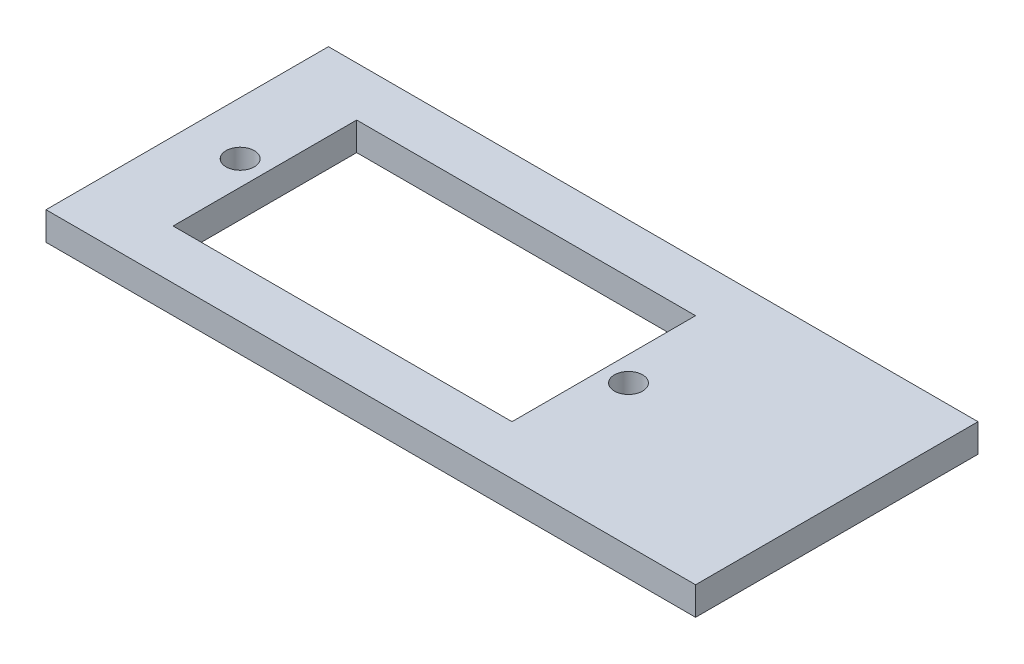
ISO-10303-21;
HEADER;
FILE_DESCRIPTION(('STEP AP214'),'2;1');
FILE_NAME('part.step','',(''),(''),'','','');
FILE_SCHEMA(('AUTOMOTIVE_DESIGN { 1 0 10303 214 1 1 1 1 }'));
ENDSEC;
DATA;
#1=APPLICATION_CONTEXT('core data for automotive mechanical design processes');
#2=APPLICATION_PROTOCOL_DEFINITION('international standard','automotive_design',2000,#1);
#3=PRODUCT_CONTEXT('',#1,'mechanical');
#4=PRODUCT('Part','Part','',(#3));
#5=PRODUCT_RELATED_PRODUCT_CATEGORY('part','',(#4));
#6=PRODUCT_DEFINITION_FORMATION('','',#4);
#7=PRODUCT_DEFINITION_CONTEXT('part definition',#1,'design');
#8=PRODUCT_DEFINITION('design','',#6,#7);
#9=PRODUCT_DEFINITION_SHAPE('','',#8);
#10=(LENGTH_UNIT() NAMED_UNIT(*) SI_UNIT(.MILLI.,.METRE.));
#11=(NAMED_UNIT(*) PLANE_ANGLE_UNIT() SI_UNIT($,.RADIAN.));
#12=(NAMED_UNIT(*) SI_UNIT($,.STERADIAN.) SOLID_ANGLE_UNIT());
#13=UNCERTAINTY_MEASURE_WITH_UNIT(LENGTH_MEASURE(1.E-05),#10,'distance_accuracy_value','');
#14=(GEOMETRIC_REPRESENTATION_CONTEXT(3) GLOBAL_UNCERTAINTY_ASSIGNED_CONTEXT((#13)) GLOBAL_UNIT_ASSIGNED_CONTEXT((#10,
#11,#12)) REPRESENTATION_CONTEXT('',''));
#15=CARTESIAN_POINT('',(0.,0.,0.));
#16=DIRECTION('',(0.,0.,1.));
#17=DIRECTION('',(1.,0.,0.));
#18=AXIS2_PLACEMENT_3D('',#15,#16,#17);
#19=CARTESIAN_POINT('',(-23.,2.,10.));
#20=DIRECTION('',(1.,0.,0.));
#21=DIRECTION('',(0.,0.,-1.));
#22=AXIS2_PLACEMENT_3D('',#19,#20,#21);
#23=PLANE('',#22);
#24=DIRECTION('',(0.,0.,1.));
#25=VECTOR('',#24,1.);
#26=CARTESIAN_POINT('',(-23.,0.,10.));
#27=LINE('',#26,#25);
#28=CARTESIAN_POINT('',(-23.,0.,-9.99999999999999));
#29=VERTEX_POINT('',#28);
#30=CARTESIAN_POINT('',(-23.,0.,10.));
#31=VERTEX_POINT('',#30);
#32=EDGE_CURVE('E136',#29,#31,#27,.T.);
#33=ORIENTED_EDGE('',*,*,#32,.T.);
#34=DIRECTION('',(0.,-1.,0.));
#35=VECTOR('',#34,1.);
#36=CARTESIAN_POINT('',(-23.,2.,10.));
#37=LINE('',#36,#35);
#38=CARTESIAN_POINT('',(-23.,2.,10.));
#39=VERTEX_POINT('',#38);
#40=EDGE_CURVE('E11',#39,#31,#37,.T.);
#41=ORIENTED_EDGE('',*,*,#40,.F.);
#42=DIRECTION('',(0.,0.,1.));
#43=VECTOR('',#42,1.);
#44=CARTESIAN_POINT('',(-23.,2.,10.));
#45=LINE('',#44,#43);
#46=CARTESIAN_POINT('',(-23.,2.,-9.99999999999999));
#47=VERTEX_POINT('',#46);
#48=EDGE_CURVE('E140',#47,#39,#45,.T.);
#49=ORIENTED_EDGE('',*,*,#48,.F.);
#50=DIRECTION('',(0.,-1.,0.));
#51=VECTOR('',#50,1.);
#52=CARTESIAN_POINT('',(-23.,2.,-9.99999999999999));
#53=LINE('',#52,#51);
#54=EDGE_CURVE('E150',#47,#29,#53,.T.);
#55=ORIENTED_EDGE('',*,*,#54,.T.);
#56=EDGE_LOOP('',(#33,#41,#49,#55));
#57=FACE_BOUND('',#56,.T.);
#58=ADVANCED_FACE('F35',(#57),#23,.F.);
#59=CARTESIAN_POINT('',(23.,2.,10.));
#60=DIRECTION('',(0.,0.,-1.));
#61=DIRECTION('',(-1.,0.,0.));
#62=AXIS2_PLACEMENT_3D('',#59,#60,#61);
#63=PLANE('',#62);
#64=DIRECTION('',(1.,0.,0.));
#65=VECTOR('',#64,1.);
#66=CARTESIAN_POINT('',(23.,0.,10.));
#67=LINE('',#66,#65);
#68=CARTESIAN_POINT('',(23.,0.,10.));
#69=VERTEX_POINT('',#68);
#70=EDGE_CURVE('E153',#31,#69,#67,.T.);
#71=ORIENTED_EDGE('',*,*,#70,.T.);
#72=DIRECTION('',(0.,-1.,0.));
#73=VECTOR('',#72,1.);
#74=CARTESIAN_POINT('',(23.,2.,10.));
#75=LINE('',#74,#73);
#76=CARTESIAN_POINT('',(23.,2.,10.));
#77=VERTEX_POINT('',#76);
#78=EDGE_CURVE('E42',#77,#69,#75,.T.);
#79=ORIENTED_EDGE('',*,*,#78,.F.);
#80=DIRECTION('',(1.,0.,0.));
#81=VECTOR('',#80,1.);
#82=CARTESIAN_POINT('',(23.,2.,10.));
#83=LINE('',#82,#81);
#84=EDGE_CURVE('E143',#39,#77,#83,.T.);
#85=ORIENTED_EDGE('',*,*,#84,.F.);
#86=ORIENTED_EDGE('',*,*,#40,.T.);
#87=EDGE_LOOP('',(#71,#79,#85,#86));
#88=FACE_BOUND('',#87,.T.);
#89=ADVANCED_FACE('F181',(#88),#63,.F.);
#90=CARTESIAN_POINT('',(23.,2.,10.));
#91=DIRECTION('',(-1.,0.,0.));
#92=DIRECTION('',(0.,0.,1.));
#93=AXIS2_PLACEMENT_3D('',#90,#91,#92);
#94=PLANE('',#93);
#95=DIRECTION('',(0.,0.,-1.));
#96=VECTOR('',#95,1.);
#97=CARTESIAN_POINT('',(23.,0.,10.));
#98=LINE('',#97,#96);
#99=CARTESIAN_POINT('',(23.,0.,-10.));
#100=VERTEX_POINT('',#99);
#101=EDGE_CURVE('E155',#69,#100,#98,.T.);
#102=ORIENTED_EDGE('',*,*,#101,.T.);
#103=DIRECTION('',(0.,-1.,0.));
#104=VECTOR('',#103,1.);
#105=CARTESIAN_POINT('',(23.,2.,-10.));
#106=LINE('',#105,#104);
#107=CARTESIAN_POINT('',(23.,2.,-10.));
#108=VERTEX_POINT('',#107);
#109=EDGE_CURVE('E160',#108,#100,#106,.T.);
#110=ORIENTED_EDGE('',*,*,#109,.F.);
#111=DIRECTION('',(0.,0.,-1.));
#112=VECTOR('',#111,1.);
#113=CARTESIAN_POINT('',(23.,2.,10.));
#114=LINE('',#113,#112);
#115=EDGE_CURVE('E146',#77,#108,#114,.T.);
#116=ORIENTED_EDGE('',*,*,#115,.F.);
#117=ORIENTED_EDGE('',*,*,#78,.T.);
#118=EDGE_LOOP('',(#102,#110,#116,#117));
#119=FACE_BOUND('',#118,.T.);
#120=ADVANCED_FACE('F167',(#119),#94,.F.);
#121=CARTESIAN_POINT('',(23.,2.,-10.));
#122=DIRECTION('',(0.,0.,1.));
#123=DIRECTION('',(1.,0.,0.));
#124=AXIS2_PLACEMENT_3D('',#121,#122,#123);
#125=PLANE('',#124);
#126=DIRECTION('',(-1.,0.,0.));
#127=VECTOR('',#126,1.);
#128=CARTESIAN_POINT('',(23.,0.,-10.));
#129=LINE('',#128,#127);
#130=EDGE_CURVE('E144',#100,#29,#129,.T.);
#131=ORIENTED_EDGE('',*,*,#130,.T.);
#132=ORIENTED_EDGE('',*,*,#54,.F.);
#133=DIRECTION('',(-1.,0.,0.));
#134=VECTOR('',#133,1.);
#135=CARTESIAN_POINT('',(23.,2.,-10.));
#136=LINE('',#135,#134);
#137=EDGE_CURVE('E148',#108,#47,#136,.T.);
#138=ORIENTED_EDGE('',*,*,#137,.F.);
#139=ORIENTED_EDGE('',*,*,#109,.T.);
#140=EDGE_LOOP('',(#131,#132,#138,#139));
#141=FACE_BOUND('',#140,.T.);
#142=ADVANCED_FACE('F174',(#141),#125,.F.);
#143=CARTESIAN_POINT('',(0.,2.,0.));
#144=DIRECTION('',(0.,1.,0.));
#145=DIRECTION('',(0.,0.,1.));
#146=AXIS2_PLACEMENT_3D('',#143,#144,#145);
#147=PLANE('',#146);
#148=CARTESIAN_POINT('',(8.25000000000001,2.,0.));
#149=DIRECTION('',(0.,1.,0.));
#150=DIRECTION('',(0.,0.,1.));
#151=AXIS2_PLACEMENT_3D('',#148,#149,#150);
#152=CIRCLE('',#151,1.);
#153=CARTESIAN_POINT('',(8.25000000000001,2.,1.));
#154=VERTEX_POINT('',#153);
#155=EDGE_CURVE('E223',#154,#154,#152,.T.);
#156=ORIENTED_EDGE('',*,*,#155,.F.);
#157=EDGE_LOOP('',(#156));
#158=FACE_BOUND('',#157,.T.);
#159=CARTESIAN_POINT('',(-19.25,2.,0.));
#160=DIRECTION('',(0.,1.,0.));
#161=DIRECTION('',(0.,0.,1.));
#162=AXIS2_PLACEMENT_3D('',#159,#160,#161);
#163=CIRCLE('',#162,1.);
#164=CARTESIAN_POINT('',(-19.25,2.,1.));
#165=VERTEX_POINT('',#164);
#166=EDGE_CURVE('E123',#165,#165,#163,.T.);
#167=ORIENTED_EDGE('',*,*,#166,.F.);
#168=EDGE_LOOP('',(#167));
#169=FACE_BOUND('',#168,.T.);
#170=DIRECTION('',(0.,0.,-1.));
#171=VECTOR('',#170,1.);
#172=CARTESIAN_POINT('',(6.50000000000001,2.,6.5));
#173=LINE('',#172,#171);
#174=CARTESIAN_POINT('',(6.50000000000001,2.,6.5));
#175=VERTEX_POINT('',#174);
#176=CARTESIAN_POINT('',(6.50000000000001,2.,-6.5));
#177=VERTEX_POINT('',#176);
#178=EDGE_CURVE('E49',#175,#177,#173,.T.);
#179=ORIENTED_EDGE('',*,*,#178,.F.);
#180=DIRECTION('',(1.,0.,0.));
#181=VECTOR('',#180,1.);
#182=CARTESIAN_POINT('',(-17.5,2.,6.5));
#183=LINE('',#182,#181);
#184=CARTESIAN_POINT('',(-17.5,2.,6.5));
#185=VERTEX_POINT('',#184);
#186=EDGE_CURVE('E117',#185,#175,#183,.T.);
#187=ORIENTED_EDGE('',*,*,#186,.F.);
#188=DIRECTION('',(0.,0.,1.));
#189=VECTOR('',#188,1.);
#190=CARTESIAN_POINT('',(-17.5,2.,6.5));
#191=LINE('',#190,#189);
#192=CARTESIAN_POINT('',(-17.5,2.,-6.5));
#193=VERTEX_POINT('',#192);
#194=EDGE_CURVE('E120',#193,#185,#191,.T.);
#195=ORIENTED_EDGE('',*,*,#194,.F.);
#196=DIRECTION('',(-1.,0.,0.));
#197=VECTOR('',#196,1.);
#198=CARTESIAN_POINT('',(-17.5,2.,-6.5));
#199=LINE('',#198,#197);
#200=EDGE_CURVE('E129',#177,#193,#199,.T.);
#201=ORIENTED_EDGE('',*,*,#200,.F.);
#202=EDGE_LOOP('',(#179,#187,#195,#201));
#203=FACE_BOUND('',#202,.T.);
#204=ORIENTED_EDGE('',*,*,#48,.T.);
#205=ORIENTED_EDGE('',*,*,#84,.T.);
#206=ORIENTED_EDGE('',*,*,#115,.T.);
#207=ORIENTED_EDGE('',*,*,#137,.T.);
#208=EDGE_LOOP('',(#204,#205,#206,#207));
#209=FACE_BOUND('',#208,.T.);
#210=ADVANCED_FACE('F180',(#158,#169,#203,#209),#147,.T.);
#211=CARTESIAN_POINT('',(0.,0.,0.));
#212=DIRECTION('',(0.,1.,0.));
#213=DIRECTION('',(0.,0.,1.));
#214=AXIS2_PLACEMENT_3D('',#211,#212,#213);
#215=PLANE('',#214);
#216=CARTESIAN_POINT('',(8.25000000000001,0.,0.));
#217=DIRECTION('',(0.,1.,0.));
#218=DIRECTION('',(0.,0.,1.));
#219=AXIS2_PLACEMENT_3D('',#216,#217,#218);
#220=CIRCLE('',#219,1.);
#221=CARTESIAN_POINT('',(8.25000000000001,0.,1.));
#222=VERTEX_POINT('',#221);
#223=EDGE_CURVE('E220',#222,#222,#220,.T.);
#224=ORIENTED_EDGE('',*,*,#223,.T.);
#225=EDGE_LOOP('',(#224));
#226=FACE_BOUND('',#225,.T.);
#227=CARTESIAN_POINT('',(-19.25,0.,0.));
#228=DIRECTION('',(0.,1.,0.));
#229=DIRECTION('',(0.,0.,1.));
#230=AXIS2_PLACEMENT_3D('',#227,#228,#229);
#231=CIRCLE('',#230,1.);
#232=CARTESIAN_POINT('',(-19.25,0.,1.));
#233=VERTEX_POINT('',#232);
#234=EDGE_CURVE('E130',#233,#233,#231,.T.);
#235=ORIENTED_EDGE('',*,*,#234,.T.);
#236=EDGE_LOOP('',(#235));
#237=FACE_BOUND('',#236,.T.);
#238=DIRECTION('',(1.,0.,0.));
#239=VECTOR('',#238,1.);
#240=CARTESIAN_POINT('',(-17.5,0.,6.5));
#241=LINE('',#240,#239);
#242=CARTESIAN_POINT('',(-17.5,0.,6.5));
#243=VERTEX_POINT('',#242);
#244=CARTESIAN_POINT('',(6.50000000000001,0.,6.5));
#245=VERTEX_POINT('',#244);
#246=EDGE_CURVE('E107',#243,#245,#241,.T.);
#247=ORIENTED_EDGE('',*,*,#246,.T.);
#248=DIRECTION('',(0.,0.,-1.));
#249=VECTOR('',#248,1.);
#250=CARTESIAN_POINT('',(6.50000000000001,0.,6.5));
#251=LINE('',#250,#249);
#252=CARTESIAN_POINT('',(6.50000000000001,0.,-6.5));
#253=VERTEX_POINT('',#252);
#254=EDGE_CURVE('E101',#245,#253,#251,.T.);
#255=ORIENTED_EDGE('',*,*,#254,.T.);
#256=DIRECTION('',(-1.,0.,0.));
#257=VECTOR('',#256,1.);
#258=CARTESIAN_POINT('',(-17.5,0.,-6.5));
#259=LINE('',#258,#257);
#260=CARTESIAN_POINT('',(-17.5,0.,-6.5));
#261=VERTEX_POINT('',#260);
#262=EDGE_CURVE('E110',#253,#261,#259,.T.);
#263=ORIENTED_EDGE('',*,*,#262,.T.);
#264=DIRECTION('',(0.,0.,1.));
#265=VECTOR('',#264,1.);
#266=CARTESIAN_POINT('',(-17.5,0.,6.5));
#267=LINE('',#266,#265);
#268=EDGE_CURVE('E57',#261,#243,#267,.T.);
#269=ORIENTED_EDGE('',*,*,#268,.T.);
#270=EDGE_LOOP('',(#247,#255,#263,#269));
#271=FACE_BOUND('',#270,.T.);
#272=ORIENTED_EDGE('',*,*,#32,.F.);
#273=ORIENTED_EDGE('',*,*,#130,.F.);
#274=ORIENTED_EDGE('',*,*,#101,.F.);
#275=ORIENTED_EDGE('',*,*,#70,.F.);
#276=EDGE_LOOP('',(#272,#273,#274,#275));
#277=FACE_BOUND('',#276,.T.);
#278=ADVANCED_FACE('F114',(#226,#237,#271,#277),#215,.F.);
#279=CARTESIAN_POINT('',(6.50000000000001,0.,6.5));
#280=DIRECTION('',(1.,0.,0.));
#281=DIRECTION('',(0.,0.,-1.));
#282=AXIS2_PLACEMENT_3D('',#279,#280,#281);
#283=PLANE('',#282);
#284=ORIENTED_EDGE('',*,*,#178,.T.);
#285=DIRECTION('',(0.,1.,0.));
#286=VECTOR('',#285,1.);
#287=CARTESIAN_POINT('',(6.50000000000001,0.,-6.5));
#288=LINE('',#287,#286);
#289=EDGE_CURVE('E97',#253,#177,#288,.T.);
#290=ORIENTED_EDGE('',*,*,#289,.F.);
#291=ORIENTED_EDGE('',*,*,#254,.F.);
#292=DIRECTION('',(0.,1.,0.));
#293=VECTOR('',#292,1.);
#294=CARTESIAN_POINT('',(6.50000000000001,0.,6.5));
#295=LINE('',#294,#293);
#296=EDGE_CURVE('E134',#245,#175,#295,.T.);
#297=ORIENTED_EDGE('',*,*,#296,.T.);
#298=EDGE_LOOP('',(#284,#290,#291,#297));
#299=FACE_BOUND('',#298,.T.);
#300=ADVANCED_FACE('F99',(#299),#283,.F.);
#301=CARTESIAN_POINT('',(-17.5,0.,6.5));
#302=DIRECTION('',(0.,0.,1.));
#303=DIRECTION('',(1.,0.,0.));
#304=AXIS2_PLACEMENT_3D('',#301,#302,#303);
#305=PLANE('',#304);
#306=ORIENTED_EDGE('',*,*,#186,.T.);
#307=ORIENTED_EDGE('',*,*,#296,.F.);
#308=ORIENTED_EDGE('',*,*,#246,.F.);
#309=DIRECTION('',(0.,1.,0.));
#310=VECTOR('',#309,1.);
#311=CARTESIAN_POINT('',(-17.5,0.,6.5));
#312=LINE('',#311,#310);
#313=EDGE_CURVE('E137',#243,#185,#312,.T.);
#314=ORIENTED_EDGE('',*,*,#313,.T.);
#315=EDGE_LOOP('',(#306,#307,#308,#314));
#316=FACE_BOUND('',#315,.T.);
#317=ADVANCED_FACE('F199',(#316),#305,.F.);
#318=CARTESIAN_POINT('',(-17.5,0.,6.5));
#319=DIRECTION('',(-1.,0.,0.));
#320=DIRECTION('',(0.,0.,1.));
#321=AXIS2_PLACEMENT_3D('',#318,#319,#320);
#322=PLANE('',#321);
#323=ORIENTED_EDGE('',*,*,#194,.T.);
#324=ORIENTED_EDGE('',*,*,#313,.F.);
#325=ORIENTED_EDGE('',*,*,#268,.F.);
#326=DIRECTION('',(0.,1.,0.));
#327=VECTOR('',#326,1.);
#328=CARTESIAN_POINT('',(-17.5,0.,-6.5));
#329=LINE('',#328,#327);
#330=EDGE_CURVE('E106',#261,#193,#329,.T.);
#331=ORIENTED_EDGE('',*,*,#330,.T.);
#332=EDGE_LOOP('',(#323,#324,#325,#331));
#333=FACE_BOUND('',#332,.T.);
#334=ADVANCED_FACE('F203',(#333),#322,.F.);
#335=CARTESIAN_POINT('',(-17.5,0.,-6.5));
#336=DIRECTION('',(0.,0.,-1.));
#337=DIRECTION('',(-1.,0.,0.));
#338=AXIS2_PLACEMENT_3D('',#335,#336,#337);
#339=PLANE('',#338);
#340=ORIENTED_EDGE('',*,*,#200,.T.);
#341=ORIENTED_EDGE('',*,*,#330,.F.);
#342=ORIENTED_EDGE('',*,*,#262,.F.);
#343=ORIENTED_EDGE('',*,*,#289,.T.);
#344=EDGE_LOOP('',(#340,#341,#342,#343));
#345=FACE_BOUND('',#344,.T.);
#346=ADVANCED_FACE('F111',(#345),#339,.F.);
#347=CARTESIAN_POINT('',(-19.25,0.,0.));
#348=DIRECTION('',(0.,1.,0.));
#349=DIRECTION('',(0.,0.,1.));
#350=AXIS2_PLACEMENT_3D('',#347,#348,#349);
#351=CYLINDRICAL_SURFACE('',#350,1.);
#352=ORIENTED_EDGE('',*,*,#234,.F.);
#353=EDGE_LOOP('',(#352));
#354=FACE_BOUND('',#353,.T.);
#355=ORIENTED_EDGE('',*,*,#166,.T.);
#356=EDGE_LOOP('',(#355));
#357=FACE_BOUND('',#356,.T.);
#358=ADVANCED_FACE('F202',(#354,#357),#351,.F.);
#359=CARTESIAN_POINT('',(8.25000000000001,0.,0.));
#360=DIRECTION('',(0.,1.,0.));
#361=DIRECTION('',(0.,0.,1.));
#362=AXIS2_PLACEMENT_3D('',#359,#360,#361);
#363=CYLINDRICAL_SURFACE('',#362,1.);
#364=ORIENTED_EDGE('',*,*,#223,.F.);
#365=EDGE_LOOP('',(#364));
#366=FACE_BOUND('',#365,.T.);
#367=ORIENTED_EDGE('',*,*,#155,.T.);
#368=EDGE_LOOP('',(#367));
#369=FACE_BOUND('',#368,.T.);
#370=ADVANCED_FACE('F211',(#366,#369),#363,.F.);
#371=CLOSED_SHELL('',(#58,#89,#120,#142,#210,#278,#300,#317,#334,#346,#358,#370));
#372=MANIFOLD_SOLID_BREP('B2',#371);
#373=ADVANCED_BREP_SHAPE_REPRESENTATION('',(#18,#372),#14);
#374=SHAPE_DEFINITION_REPRESENTATION(#9,#373);
ENDSEC;
END-ISO-10303-21;
